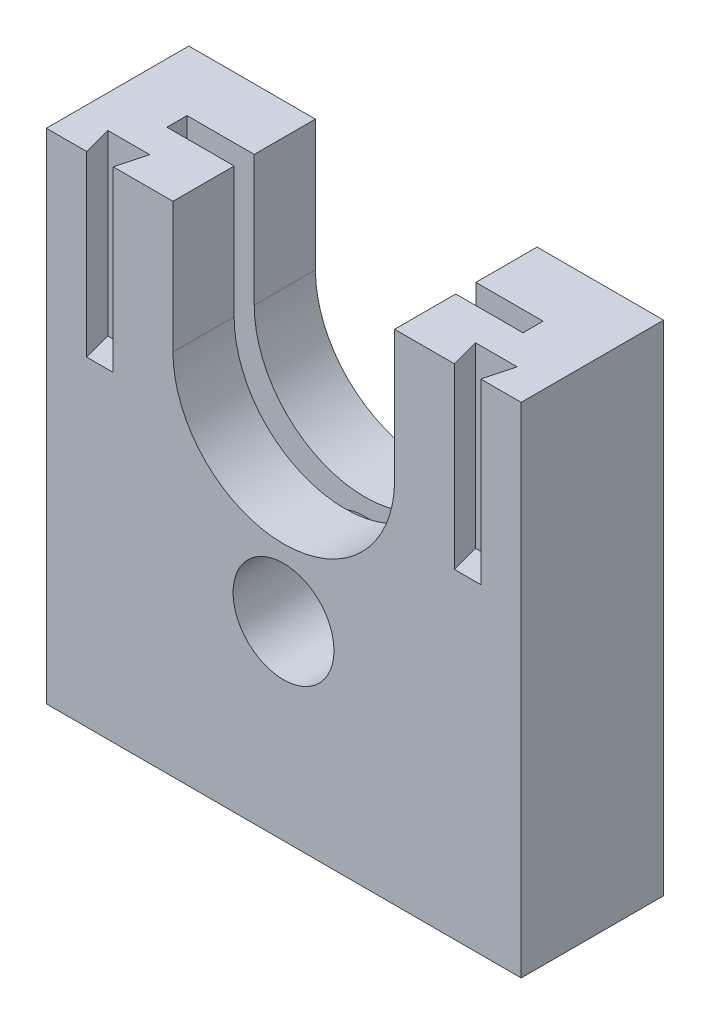
ISO-10303-21;
HEADER;
FILE_DESCRIPTION(('STEP AP214'),'2;1');
FILE_NAME('part.step','',(''),(''),'','','');
FILE_SCHEMA(('AUTOMOTIVE_DESIGN { 1 0 10303 214 1 1 1 1 }'));
ENDSEC;
DATA;
#1=APPLICATION_CONTEXT('core data for automotive mechanical design processes');
#2=APPLICATION_PROTOCOL_DEFINITION('international standard','automotive_design',2000,#1);
#3=PRODUCT_CONTEXT('',#1,'mechanical');
#4=PRODUCT('Part','Part','',(#3));
#5=PRODUCT_RELATED_PRODUCT_CATEGORY('part','',(#4));
#6=PRODUCT_DEFINITION_FORMATION('','',#4);
#7=PRODUCT_DEFINITION_CONTEXT('part definition',#1,'design');
#8=PRODUCT_DEFINITION('design','',#6,#7);
#9=PRODUCT_DEFINITION_SHAPE('','',#8);
#10=(LENGTH_UNIT() NAMED_UNIT(*) SI_UNIT(.MILLI.,.METRE.));
#11=(NAMED_UNIT(*) PLANE_ANGLE_UNIT() SI_UNIT($,.RADIAN.));
#12=(NAMED_UNIT(*) SI_UNIT($,.STERADIAN.) SOLID_ANGLE_UNIT());
#13=UNCERTAINTY_MEASURE_WITH_UNIT(LENGTH_MEASURE(1.E-05),#10,'distance_accuracy_value','');
#14=(GEOMETRIC_REPRESENTATION_CONTEXT(3) GLOBAL_UNCERTAINTY_ASSIGNED_CONTEXT((#13)) GLOBAL_UNIT_ASSIGNED_CONTEXT((#10,
#11,#12)) REPRESENTATION_CONTEXT('',''));
#15=CARTESIAN_POINT('',(0.,0.,0.));
#16=DIRECTION('',(0.,0.,1.));
#17=DIRECTION('',(1.,0.,0.));
#18=AXIS2_PLACEMENT_3D('',#15,#16,#17);
#19=CARTESIAN_POINT('',(0.,7.46153846153847,0.));
#20=DIRECTION('',(0.,-1.,0.));
#21=DIRECTION('',(0.,0.,-1.));
#22=AXIS2_PLACEMENT_3D('',#19,#20,#21);
#23=PLANE('',#22);
#24=DIRECTION('',(-1.,0.,0.));
#25=VECTOR('',#24,1.);
#26=CARTESIAN_POINT('',(-16.4871794871795,7.46153846153847,5.15229744595904));
#27=LINE('',#26,#25);
#28=CARTESIAN_POINT('',(13.5128205128205,7.46153846153847,5.15229744595904));
#29=VERTEX_POINT('',#28);
#30=CARTESIAN_POINT('',(2.62131782107196,7.46153846153847,5.15229744595904));
#31=VERTEX_POINT('',#30);
#32=EDGE_CURVE('E273',#29,#31,#27,.T.);
#33=ORIENTED_EDGE('',*,*,#32,.T.);
#34=DIRECTION('',(0.,0.,1.));
#35=VECTOR('',#34,1.);
#36=CARTESIAN_POINT('',(2.62131782107196,7.46153846153847,4.9));
#37=LINE('',#36,#35);
#38=CARTESIAN_POINT('',(2.62131782107196,7.46153846153847,6.84770255404097));
#39=VERTEX_POINT('',#38);
#40=EDGE_CURVE('E11',#31,#39,#37,.T.);
#41=ORIENTED_EDGE('',*,*,#40,.T.);
#42=DIRECTION('',(1.,0.,0.));
#43=VECTOR('',#42,1.);
#44=CARTESIAN_POINT('',(-16.4871794871795,7.46153846153847,6.84770255404097));
#45=LINE('',#44,#43);
#46=CARTESIAN_POINT('',(13.5128205128205,7.46153846153847,6.84770255404097));
#47=VERTEX_POINT('',#46);
#48=EDGE_CURVE('E279',#39,#47,#45,.T.);
#49=ORIENTED_EDGE('',*,*,#48,.T.);
#50=DIRECTION('',(0.,0.,-1.));
#51=VECTOR('',#50,1.);
#52=CARTESIAN_POINT('',(13.5128205128205,7.46153846153847,6.84770255404097));
#53=LINE('',#52,#51);
#54=EDGE_CURVE('E268',#47,#29,#53,.T.);
#55=ORIENTED_EDGE('',*,*,#54,.T.);
#56=EDGE_LOOP('',(#33,#41,#49,#55));
#57=FACE_BOUND('',#56,.T.);
#58=ADVANCED_FACE('F37',(#57),#23,.F.);
#59=CARTESIAN_POINT('',(-1.4871794871795,21.4615384615385,0.));
#60=DIRECTION('',(0.,0.,1.));
#61=DIRECTION('',(1.,0.,0.));
#62=AXIS2_PLACEMENT_3D('',#59,#60,#61);
#63=CYLINDRICAL_SURFACE('',#62,9.33629045959129);
#64=DIRECTION('',(0.,0.,1.));
#65=VECTOR('',#64,1.);
#66=CARTESIAN_POINT('',(7.84911097241179,21.4615384615385,0.));
#67=LINE('',#66,#65);
#68=CARTESIAN_POINT('',(7.84911097241179,21.4615384615385,6.84770255404097));
#69=VERTEX_POINT('',#68);
#70=CARTESIAN_POINT('',(7.84911097241179,21.4615384615385,12.));
#71=VERTEX_POINT('',#70);
#72=EDGE_CURVE('E322',#69,#71,#67,.T.);
#73=ORIENTED_EDGE('',*,*,#72,.F.);
#74=CARTESIAN_POINT('',(-1.4871794871795,21.4615384615385,6.84770255404097));
#75=DIRECTION('',(0.,0.,1.));
#76=DIRECTION('',(1.,0.,0.));
#77=AXIS2_PLACEMENT_3D('',#74,#75,#76);
#78=CIRCLE('',#77,9.33629045959129);
#79=CARTESIAN_POINT('',(-10.8234699467708,21.4615384615385,6.84770255404097));
#80=VERTEX_POINT('',#79);
#81=EDGE_CURVE('E308',#69,#80,#78,.F.);
#82=ORIENTED_EDGE('',*,*,#81,.T.);
#83=DIRECTION('',(0.,0.,1.));
#84=VECTOR('',#83,1.);
#85=CARTESIAN_POINT('',(-10.8234699467708,21.4615384615385,0.));
#86=LINE('',#85,#84);
#87=CARTESIAN_POINT('',(-10.8234699467708,21.4615384615385,12.));
#88=VERTEX_POINT('',#87);
#89=EDGE_CURVE('E334',#80,#88,#86,.T.);
#90=ORIENTED_EDGE('',*,*,#89,.T.);
#91=CARTESIAN_POINT('',(-1.4871794871795,21.4615384615385,12.));
#92=DIRECTION('',(0.,0.,1.));
#93=DIRECTION('',(1.,0.,0.));
#94=AXIS2_PLACEMENT_3D('',#91,#92,#93);
#95=CIRCLE('',#94,9.33629045959129);
#96=EDGE_CURVE('E314',#88,#71,#95,.T.);
#97=ORIENTED_EDGE('',*,*,#96,.T.);
#98=EDGE_LOOP('',(#73,#82,#90,#97));
#99=FACE_BOUND('',#98,.T.);
#100=ADVANCED_FACE('F454',(#99),#63,.F.);
#101=CARTESIAN_POINT('',(-10.8234699467708,21.4615384615385,0.));
#102=DIRECTION('',(-1.,0.,0.));
#103=DIRECTION('',(0.,0.,1.));
#104=AXIS2_PLACEMENT_3D('',#101,#102,#103);
#105=PLANE('',#104);
#106=ORIENTED_EDGE('',*,*,#89,.F.);
#107=DIRECTION('',(0.,1.,0.));
#108=VECTOR('',#107,1.);
#109=CARTESIAN_POINT('',(-10.8234699467708,21.4615384615385,6.84770255404097));
#110=LINE('',#109,#108);
#111=CARTESIAN_POINT('',(-10.8234699467708,32.4615384615385,6.84770255404097));
#112=VERTEX_POINT('',#111);
#113=EDGE_CURVE('E311',#80,#112,#110,.T.);
#114=ORIENTED_EDGE('',*,*,#113,.T.);
#115=DIRECTION('',(0.,0.,1.));
#116=VECTOR('',#115,1.);
#117=CARTESIAN_POINT('',(-10.8234699467708,32.4615384615385,0.));
#118=LINE('',#117,#116);
#119=CARTESIAN_POINT('',(-10.8234699467708,32.4615384615385,12.));
#120=VERTEX_POINT('',#119);
#121=EDGE_CURVE('E338',#112,#120,#118,.T.);
#122=ORIENTED_EDGE('',*,*,#121,.T.);
#123=DIRECTION('',(0.,-1.,0.));
#124=VECTOR('',#123,1.);
#125=CARTESIAN_POINT('',(-10.8234699467708,21.4615384615385,12.));
#126=LINE('',#125,#124);
#127=EDGE_CURVE('E317',#120,#88,#126,.T.);
#128=ORIENTED_EDGE('',*,*,#127,.T.);
#129=EDGE_LOOP('',(#106,#114,#122,#128));
#130=FACE_BOUND('',#129,.T.);
#131=ADVANCED_FACE('F449',(#130),#105,.F.);
#132=CARTESIAN_POINT('',(7.84911097241179,21.4615384615385,0.));
#133=DIRECTION('',(1.,0.,0.));
#134=DIRECTION('',(0.,0.,-1.));
#135=AXIS2_PLACEMENT_3D('',#132,#133,#134);
#136=PLANE('',#135);
#137=DIRECTION('',(0.,0.,1.));
#138=VECTOR('',#137,1.);
#139=CARTESIAN_POINT('',(7.84911097241179,32.4615384615385,0.));
#140=LINE('',#139,#138);
#141=CARTESIAN_POINT('',(7.84911097241179,32.4615384615385,6.84770255404097));
#142=VERTEX_POINT('',#141);
#143=CARTESIAN_POINT('',(7.84911097241179,32.4615384615385,12.));
#144=VERTEX_POINT('',#143);
#145=EDGE_CURVE('E341',#142,#144,#140,.T.);
#146=ORIENTED_EDGE('',*,*,#145,.F.);
#147=DIRECTION('',(0.,-1.,0.));
#148=VECTOR('',#147,1.);
#149=CARTESIAN_POINT('',(7.84911097241179,21.4615384615385,6.84770255404097));
#150=LINE('',#149,#148);
#151=EDGE_CURVE('E410',#142,#69,#150,.T.);
#152=ORIENTED_EDGE('',*,*,#151,.T.);
#153=ORIENTED_EDGE('',*,*,#72,.T.);
#154=DIRECTION('',(0.,1.,0.));
#155=VECTOR('',#154,1.);
#156=CARTESIAN_POINT('',(7.84911097241179,21.4615384615385,12.));
#157=LINE('',#156,#155);
#158=EDGE_CURVE('E325',#71,#144,#157,.T.);
#159=ORIENTED_EDGE('',*,*,#158,.T.);
#160=EDGE_LOOP('',(#146,#152,#153,#159));
#161=FACE_BOUND('',#160,.T.);
#162=ADVANCED_FACE('F458',(#161),#136,.F.);
#163=CARTESIAN_POINT('',(-19.4871794871795,32.4615384615385,12.));
#164=DIRECTION('',(0.,-1.,0.));
#165=DIRECTION('',(0.,0.,-1.));
#166=AXIS2_PLACEMENT_3D('',#163,#164,#165);
#167=PLANE('',#166);
#168=ORIENTED_EDGE('',*,*,#121,.F.);
#169=DIRECTION('',(1.,0.,0.));
#170=VECTOR('',#169,1.);
#171=CARTESIAN_POINT('',(-16.4871794871795,32.4615384615385,6.84770255404097));
#172=LINE('',#171,#170);
#173=CARTESIAN_POINT('',(-16.4871794871795,32.4615384615385,6.84770255404097));
#174=VERTEX_POINT('',#173);
#175=EDGE_CURVE('E272',#174,#112,#172,.T.);
#176=ORIENTED_EDGE('',*,*,#175,.F.);
#177=DIRECTION('',(0.,0.,1.));
#178=VECTOR('',#177,1.);
#179=CARTESIAN_POINT('',(-16.4871794871795,32.4615384615385,6.84770255404097));
#180=LINE('',#179,#178);
#181=CARTESIAN_POINT('',(-16.4871794871795,32.4615384615385,5.15229744595904));
#182=VERTEX_POINT('',#181);
#183=EDGE_CURVE('E288',#182,#174,#180,.T.);
#184=ORIENTED_EDGE('',*,*,#183,.F.);
#185=DIRECTION('',(-1.,0.,0.));
#186=VECTOR('',#185,1.);
#187=CARTESIAN_POINT('',(-16.4871794871795,32.4615384615385,5.15229744595904));
#188=LINE('',#187,#186);
#189=CARTESIAN_POINT('',(-10.8234699467708,32.4615384615385,5.15229744595904));
#190=VERTEX_POINT('',#189);
#191=EDGE_CURVE('E286',#190,#182,#188,.T.);
#192=ORIENTED_EDGE('',*,*,#191,.F.);
#193=CARTESIAN_POINT('',(-10.8234699467708,32.4615384615385,0.));
#194=VERTEX_POINT('',#193);
#195=EDGE_CURVE('E335',#194,#190,#118,.T.);
#196=ORIENTED_EDGE('',*,*,#195,.F.);
#197=DIRECTION('',(-1.,0.,0.));
#198=VECTOR('',#197,1.);
#199=CARTESIAN_POINT('',(-19.4871794871795,32.4615384615385,0.));
#200=LINE('',#199,#198);
#201=CARTESIAN_POINT('',(-21.4871794871795,32.4615384615385,0.));
#202=VERTEX_POINT('',#201);
#203=EDGE_CURVE('E224',#194,#202,#200,.T.);
#204=ORIENTED_EDGE('',*,*,#203,.T.);
#205=DIRECTION('',(0.,0.,1.));
#206=VECTOR('',#205,1.);
#207=CARTESIAN_POINT('',(-21.4871794871795,32.4615384615385,0.));
#208=LINE('',#207,#206);
#209=CARTESIAN_POINT('',(-21.4871794871795,32.4615384615385,12.));
#210=VERTEX_POINT('',#209);
#211=EDGE_CURVE('E241',#202,#210,#208,.T.);
#212=ORIENTED_EDGE('',*,*,#211,.T.);
#213=DIRECTION('',(-1.,0.,0.));
#214=VECTOR('',#213,1.);
#215=CARTESIAN_POINT('',(-19.4871794871795,32.4615384615385,12.));
#216=LINE('',#215,#214);
#217=CARTESIAN_POINT('',(-18.0871794871795,32.4615384615385,12.));
#218=VERTEX_POINT('',#217);
#219=EDGE_CURVE('E403',#218,#210,#216,.T.);
#220=ORIENTED_EDGE('',*,*,#219,.F.);
#221=DIRECTION('',(0.258819045102518,0.,0.965925826289069));
#222=VECTOR('',#221,1.);
#223=CARTESIAN_POINT('',(-18.0871794871795,32.4615384615385,12.));
#224=LINE('',#223,#222);
#225=CARTESIAN_POINT('',(-18.736956278825,32.4615384615385,9.575));
#226=VERTEX_POINT('',#225);
#227=EDGE_CURVE('E349',#226,#218,#224,.T.);
#228=ORIENTED_EDGE('',*,*,#227,.F.);
#229=DIRECTION('',(-1.,0.,0.));
#230=VECTOR('',#229,1.);
#231=CARTESIAN_POINT('',(-18.736956278825,32.4615384615385,9.575));
#232=LINE('',#231,#230);
#233=CARTESIAN_POINT('',(-15.212402695534,32.4615384615385,9.575));
#234=VERTEX_POINT('',#233);
#235=EDGE_CURVE('E361',#234,#226,#232,.T.);
#236=ORIENTED_EDGE('',*,*,#235,.F.);
#237=DIRECTION('',(0.258819045102518,0.,-0.965925826289069));
#238=VECTOR('',#237,1.);
#239=CARTESIAN_POINT('',(-15.212402695534,32.4615384615385,9.575));
#240=LINE('',#239,#238);
#241=CARTESIAN_POINT('',(-15.8621794871795,32.4615384615385,12.));
#242=VERTEX_POINT('',#241);
#243=EDGE_CURVE('E358',#242,#234,#240,.T.);
#244=ORIENTED_EDGE('',*,*,#243,.F.);
#245=EDGE_CURVE('E407',#120,#242,#216,.T.);
#246=ORIENTED_EDGE('',*,*,#245,.F.);
#247=EDGE_LOOP('',(#168,#176,#184,#192,#196,#204,#212,#220,#228,#236,#244,#246));
#248=FACE_BOUND('',#247,.T.);
#249=ADVANCED_FACE('F444',(#248),#167,.F.);
#250=CARTESIAN_POINT('',(-19.4871794871795,-9.53846153846153,12.));
#251=DIRECTION('',(0.,1.,0.));
#252=DIRECTION('',(0.,0.,1.));
#253=AXIS2_PLACEMENT_3D('',#250,#251,#252);
#254=PLANE('',#253);
#255=DIRECTION('',(1.,0.,0.));
#256=VECTOR('',#255,1.);
#257=CARTESIAN_POINT('',(-19.4871794871795,-9.53846153846153,0.));
#258=LINE('',#257,#256);
#259=CARTESIAN_POINT('',(-21.4871794871795,-9.53846153846153,0.));
#260=VERTEX_POINT('',#259);
#261=CARTESIAN_POINT('',(18.5128205128205,-9.53846153846153,0.));
#262=VERTEX_POINT('',#261);
#263=EDGE_CURVE('E369',#260,#262,#258,.T.);
#264=ORIENTED_EDGE('',*,*,#263,.T.);
#265=DIRECTION('',(0.,0.,-1.));
#266=VECTOR('',#265,1.);
#267=CARTESIAN_POINT('',(18.5128205128205,-9.53846153846153,0.));
#268=LINE('',#267,#266);
#269=CARTESIAN_POINT('',(18.5128205128205,-9.53846153846153,12.));
#270=VERTEX_POINT('',#269);
#271=EDGE_CURVE('E232',#270,#262,#268,.T.);
#272=ORIENTED_EDGE('',*,*,#271,.F.);
#273=DIRECTION('',(1.,0.,0.));
#274=VECTOR('',#273,1.);
#275=CARTESIAN_POINT('',(-19.4871794871795,-9.53846153846153,12.));
#276=LINE('',#275,#274);
#277=CARTESIAN_POINT('',(-21.4871794871795,-9.53846153846153,12.));
#278=VERTEX_POINT('',#277);
#279=EDGE_CURVE('E223',#278,#270,#276,.T.);
#280=ORIENTED_EDGE('',*,*,#279,.F.);
#281=DIRECTION('',(0.,0.,1.));
#282=VECTOR('',#281,1.);
#283=CARTESIAN_POINT('',(-21.4871794871795,-9.53846153846153,0.));
#284=LINE('',#283,#282);
#285=EDGE_CURVE('E244',#260,#278,#284,.T.);
#286=ORIENTED_EDGE('',*,*,#285,.F.);
#287=EDGE_LOOP('',(#264,#272,#280,#286));
#288=FACE_BOUND('',#287,.T.);
#289=ADVANCED_FACE('F39',(#288),#254,.F.);
#290=DIRECTION('',(0.,0.,-1.));
#291=VECTOR('',#290,1.);
#292=CARTESIAN_POINT('',(13.5128205128205,32.4615384615385,6.84770255404097));
#293=LINE('',#292,#291);
#294=CARTESIAN_POINT('',(13.5128205128205,32.4615384615385,6.84770255404097));
#295=VERTEX_POINT('',#294);
#296=CARTESIAN_POINT('',(13.5128205128205,32.4615384615385,5.15229744595904));
#297=VERTEX_POINT('',#296);
#298=EDGE_CURVE('E267',#295,#297,#293,.T.);
#299=ORIENTED_EDGE('',*,*,#298,.F.);
#300=EDGE_CURVE('E291',#142,#295,#172,.T.);
#301=ORIENTED_EDGE('',*,*,#300,.F.);
#302=ORIENTED_EDGE('',*,*,#145,.T.);
#303=CARTESIAN_POINT('',(12.8878205128205,32.4615384615385,12.));
#304=VERTEX_POINT('',#303);
#305=EDGE_CURVE('E406',#304,#144,#216,.T.);
#306=ORIENTED_EDGE('',*,*,#305,.F.);
#307=DIRECTION('',(0.258819045102525,0.,0.965925826289067));
#308=VECTOR('',#307,1.);
#309=CARTESIAN_POINT('',(12.238043721175,32.4615384615385,9.575));
#310=LINE('',#309,#308);
#311=CARTESIAN_POINT('',(12.238043721175,32.4615384615385,9.575));
#312=VERTEX_POINT('',#311);
#313=EDGE_CURVE('E385',#312,#304,#310,.T.);
#314=ORIENTED_EDGE('',*,*,#313,.F.);
#315=DIRECTION('',(-1.,0.,0.));
#316=VECTOR('',#315,1.);
#317=CARTESIAN_POINT('',(15.762597304466,32.4615384615385,9.575));
#318=LINE('',#317,#316);
#319=CARTESIAN_POINT('',(15.762597304466,32.4615384615385,9.575));
#320=VERTEX_POINT('',#319);
#321=EDGE_CURVE('E387',#320,#312,#318,.T.);
#322=ORIENTED_EDGE('',*,*,#321,.F.);
#323=DIRECTION('',(0.258819045102525,0.,-0.965925826289067));
#324=VECTOR('',#323,1.);
#325=CARTESIAN_POINT('',(15.1128205128205,32.4615384615385,12.));
#326=LINE('',#325,#324);
#327=CARTESIAN_POINT('',(15.1128205128205,32.4615384615385,12.));
#328=VERTEX_POINT('',#327);
#329=EDGE_CURVE('E362',#328,#320,#326,.T.);
#330=ORIENTED_EDGE('',*,*,#329,.F.);
#331=CARTESIAN_POINT('',(18.5128205128205,32.4615384615385,12.));
#332=VERTEX_POINT('',#331);
#333=EDGE_CURVE('E239',#332,#328,#216,.T.);
#334=ORIENTED_EDGE('',*,*,#333,.F.);
#335=DIRECTION('',(0.,0.,-1.));
#336=VECTOR('',#335,1.);
#337=CARTESIAN_POINT('',(18.5128205128205,32.4615384615385,0.));
#338=LINE('',#337,#336);
#339=CARTESIAN_POINT('',(18.5128205128205,32.4615384615385,0.));
#340=VERTEX_POINT('',#339);
#341=EDGE_CURVE('E230',#332,#340,#338,.T.);
#342=ORIENTED_EDGE('',*,*,#341,.T.);
#343=CARTESIAN_POINT('',(7.84911097241179,32.4615384615385,0.));
#344=VERTEX_POINT('',#343);
#345=EDGE_CURVE('E211',#340,#344,#200,.T.);
#346=ORIENTED_EDGE('',*,*,#345,.T.);
#347=CARTESIAN_POINT('',(7.84911097241179,32.4615384615385,5.15229744595904));
#348=VERTEX_POINT('',#347);
#349=EDGE_CURVE('E339',#344,#348,#140,.T.);
#350=ORIENTED_EDGE('',*,*,#349,.T.);
#351=EDGE_CURVE('E60',#297,#348,#188,.T.);
#352=ORIENTED_EDGE('',*,*,#351,.F.);
#353=EDGE_LOOP('',(#299,#301,#302,#306,#314,#322,#330,#334,#342,#346,#350,#352));
#354=FACE_BOUND('',#353,.T.);
#355=ADVANCED_FACE('F236',(#354),#167,.F.);
#356=CARTESIAN_POINT('',(0.,0.,12.));
#357=DIRECTION('',(0.,0.,1.));
#358=DIRECTION('',(1.,0.,0.));
#359=AXIS2_PLACEMENT_3D('',#356,#357,#358);
#360=PLANE('',#359);
#361=CARTESIAN_POINT('',(-1.50936008939262,6.46153846153847,12.));
#362=DIRECTION('',(0.,0.,1.));
#363=DIRECTION('',(1.,0.,0.));
#364=AXIS2_PLACEMENT_3D('',#361,#362,#363);
#365=CIRCLE('',#364,4.25);
#366=CARTESIAN_POINT('',(2.74063991060738,6.46153846153847,12.));
#367=VERTEX_POINT('',#366);
#368=EDGE_CURVE('E255',#367,#367,#365,.T.);
#369=ORIENTED_EDGE('',*,*,#368,.F.);
#370=EDGE_LOOP('',(#369));
#371=FACE_BOUND('',#370,.T.);
#372=ORIENTED_EDGE('',*,*,#127,.F.);
#373=ORIENTED_EDGE('',*,*,#245,.T.);
#374=DIRECTION('',(0.,1.,0.));
#375=VECTOR('',#374,1.);
#376=CARTESIAN_POINT('',(-15.8621794871795,17.4615384615385,12.));
#377=LINE('',#376,#375);
#378=CARTESIAN_POINT('',(-15.8621794871795,17.4615384615385,12.));
#379=VERTEX_POINT('',#378);
#380=EDGE_CURVE('E357',#379,#242,#377,.T.);
#381=ORIENTED_EDGE('',*,*,#380,.F.);
#382=DIRECTION('',(1.,0.,0.));
#383=VECTOR('',#382,1.);
#384=CARTESIAN_POINT('',(-18.0871794871795,17.4615384615385,12.));
#385=LINE('',#384,#383);
#386=CARTESIAN_POINT('',(-18.0871794871795,17.4615384615385,12.));
#387=VERTEX_POINT('',#386);
#388=EDGE_CURVE('E345',#387,#379,#385,.T.);
#389=ORIENTED_EDGE('',*,*,#388,.F.);
#390=DIRECTION('',(0.,1.,0.));
#391=VECTOR('',#390,1.);
#392=CARTESIAN_POINT('',(-18.0871794871795,17.4615384615385,12.));
#393=LINE('',#392,#391);
#394=EDGE_CURVE('E366',#387,#218,#393,.T.);
#395=ORIENTED_EDGE('',*,*,#394,.T.);
#396=ORIENTED_EDGE('',*,*,#219,.T.);
#397=DIRECTION('',(0.,1.,0.));
#398=VECTOR('',#397,1.);
#399=CARTESIAN_POINT('',(-21.4871794871795,-9.53846153846153,12.));
#400=LINE('',#399,#398);
#401=EDGE_CURVE('E252',#278,#210,#400,.T.);
#402=ORIENTED_EDGE('',*,*,#401,.F.);
#403=ORIENTED_EDGE('',*,*,#279,.T.);
#404=DIRECTION('',(0.,1.,0.));
#405=VECTOR('',#404,1.);
#406=CARTESIAN_POINT('',(18.5128205128205,-9.53846153846153,12.));
#407=LINE('',#406,#405);
#408=EDGE_CURVE('E233',#270,#332,#407,.T.);
#409=ORIENTED_EDGE('',*,*,#408,.T.);
#410=ORIENTED_EDGE('',*,*,#333,.T.);
#411=DIRECTION('',(0.,1.,0.));
#412=VECTOR('',#411,1.);
#413=CARTESIAN_POINT('',(15.1128205128205,17.4615384615385,12.));
#414=LINE('',#413,#412);
#415=CARTESIAN_POINT('',(15.1128205128205,17.4615384615385,12.));
#416=VERTEX_POINT('',#415);
#417=EDGE_CURVE('E376',#416,#328,#414,.T.);
#418=ORIENTED_EDGE('',*,*,#417,.F.);
#419=DIRECTION('',(1.,0.,0.));
#420=VECTOR('',#419,1.);
#421=CARTESIAN_POINT('',(15.1128205128205,17.4615384615385,12.));
#422=LINE('',#421,#420);
#423=CARTESIAN_POINT('',(12.8878205128205,17.4615384615385,12.));
#424=VERTEX_POINT('',#423);
#425=EDGE_CURVE('E388',#424,#416,#422,.T.);
#426=ORIENTED_EDGE('',*,*,#425,.F.);
#427=DIRECTION('',(0.,1.,0.));
#428=VECTOR('',#427,1.);
#429=CARTESIAN_POINT('',(12.8878205128205,17.4615384615385,12.));
#430=LINE('',#429,#428);
#431=EDGE_CURVE('E333',#424,#304,#430,.T.);
#432=ORIENTED_EDGE('',*,*,#431,.T.);
#433=ORIENTED_EDGE('',*,*,#305,.T.);
#434=ORIENTED_EDGE('',*,*,#158,.F.);
#435=ORIENTED_EDGE('',*,*,#96,.F.);
#436=EDGE_LOOP('',(#372,#373,#381,#389,#395,#396,#402,#403,#409,#410,#418,#426,#432,#433,#434,#435));
#437=FACE_BOUND('',#436,.T.);
#438=ADVANCED_FACE('F466',(#371,#437),#360,.T.);
#439=CARTESIAN_POINT('',(0.,0.,0.));
#440=DIRECTION('',(0.,0.,1.));
#441=DIRECTION('',(1.,0.,0.));
#442=AXIS2_PLACEMENT_3D('',#439,#440,#441);
#443=PLANE('',#442);
#444=ORIENTED_EDGE('',*,*,#203,.F.);
#445=DIRECTION('',(0.,-1.,0.));
#446=VECTOR('',#445,1.);
#447=CARTESIAN_POINT('',(-10.8234699467708,21.4615384615385,0.));
#448=LINE('',#447,#446);
#449=CARTESIAN_POINT('',(-10.8234699467708,21.4615384615385,0.));
#450=VERTEX_POINT('',#449);
#451=EDGE_CURVE('E319',#194,#450,#448,.T.);
#452=ORIENTED_EDGE('',*,*,#451,.T.);
#453=CARTESIAN_POINT('',(-1.4871794871795,21.4615384615385,0.));
#454=DIRECTION('',(0.,0.,1.));
#455=DIRECTION('',(1.,0.,0.));
#456=AXIS2_PLACEMENT_3D('',#453,#454,#455);
#457=CIRCLE('',#456,9.33629045959129);
#458=CARTESIAN_POINT('',(7.84911097241179,21.4615384615385,0.));
#459=VERTEX_POINT('',#458);
#460=EDGE_CURVE('E315',#450,#459,#457,.T.);
#461=ORIENTED_EDGE('',*,*,#460,.T.);
#462=DIRECTION('',(0.,1.,0.));
#463=VECTOR('',#462,1.);
#464=CARTESIAN_POINT('',(7.84911097241179,21.4615384615385,0.));
#465=LINE('',#464,#463);
#466=EDGE_CURVE('E219',#459,#344,#465,.T.);
#467=ORIENTED_EDGE('',*,*,#466,.T.);
#468=ORIENTED_EDGE('',*,*,#345,.F.);
#469=DIRECTION('',(0.,1.,0.));
#470=VECTOR('',#469,1.);
#471=CARTESIAN_POINT('',(18.5128205128205,-9.53846153846153,0.));
#472=LINE('',#471,#470);
#473=EDGE_CURVE('E215',#262,#340,#472,.T.);
#474=ORIENTED_EDGE('',*,*,#473,.F.);
#475=ORIENTED_EDGE('',*,*,#263,.F.);
#476=DIRECTION('',(0.,1.,0.));
#477=VECTOR('',#476,1.);
#478=CARTESIAN_POINT('',(-21.4871794871795,-9.53846153846153,0.));
#479=LINE('',#478,#477);
#480=EDGE_CURVE('E250',#260,#202,#479,.T.);
#481=ORIENTED_EDGE('',*,*,#480,.T.);
#482=EDGE_LOOP('',(#444,#452,#461,#467,#468,#474,#475,#481));
#483=FACE_BOUND('',#482,.T.);
#484=ADVANCED_FACE('F214',(#483),#443,.F.);
#485=CARTESIAN_POINT('',(12.238043721175,17.4615384615385,9.575));
#486=DIRECTION('',(-0.965925826289067,0.,0.258819045102525));
#487=DIRECTION('',(0.258819045102525,0.,0.965925826289067));
#488=AXIS2_PLACEMENT_3D('',#485,#486,#487);
#489=PLANE('',#488);
#490=ORIENTED_EDGE('',*,*,#313,.T.);
#491=ORIENTED_EDGE('',*,*,#431,.F.);
#492=DIRECTION('',(0.258819045102525,0.,0.965925826289067));
#493=VECTOR('',#492,1.);
#494=CARTESIAN_POINT('',(12.238043721175,17.4615384615385,9.575));
#495=LINE('',#494,#493);
#496=CARTESIAN_POINT('',(12.238043721175,17.4615384615385,9.575));
#497=VERTEX_POINT('',#496);
#498=EDGE_CURVE('E378',#497,#424,#495,.T.);
#499=ORIENTED_EDGE('',*,*,#498,.F.);
#500=DIRECTION('',(0.,1.,0.));
#501=VECTOR('',#500,1.);
#502=CARTESIAN_POINT('',(12.238043721175,17.4615384615385,9.575));
#503=LINE('',#502,#501);
#504=EDGE_CURVE('E381',#497,#312,#503,.T.);
#505=ORIENTED_EDGE('',*,*,#504,.T.);
#506=EDGE_LOOP('',(#490,#491,#499,#505));
#507=FACE_BOUND('',#506,.T.);
#508=ADVANCED_FACE('F488',(#507),#489,.F.);
#509=CARTESIAN_POINT('',(15.762597304466,17.4615384615385,9.575));
#510=DIRECTION('',(0.,0.,-1.));
#511=DIRECTION('',(-1.,0.,0.));
#512=AXIS2_PLACEMENT_3D('',#509,#510,#511);
#513=PLANE('',#512);
#514=ORIENTED_EDGE('',*,*,#321,.T.);
#515=ORIENTED_EDGE('',*,*,#504,.F.);
#516=DIRECTION('',(-1.,0.,0.));
#517=VECTOR('',#516,1.);
#518=CARTESIAN_POINT('',(15.762597304466,17.4615384615385,9.575));
#519=LINE('',#518,#517);
#520=CARTESIAN_POINT('',(15.762597304466,17.4615384615385,9.575));
#521=VERTEX_POINT('',#520);
#522=EDGE_CURVE('E394',#521,#497,#519,.T.);
#523=ORIENTED_EDGE('',*,*,#522,.F.);
#524=DIRECTION('',(0.,1.,0.));
#525=VECTOR('',#524,1.);
#526=CARTESIAN_POINT('',(15.762597304466,17.4615384615385,9.575));
#527=LINE('',#526,#525);
#528=EDGE_CURVE('E379',#521,#320,#527,.T.);
#529=ORIENTED_EDGE('',*,*,#528,.T.);
#530=EDGE_LOOP('',(#514,#515,#523,#529));
#531=FACE_BOUND('',#530,.T.);
#532=ADVANCED_FACE('F481',(#531),#513,.F.);
#533=CARTESIAN_POINT('',(15.1128205128205,17.4615384615385,12.));
#534=DIRECTION('',(0.965925826289067,0.,0.258819045102525));
#535=DIRECTION('',(0.258819045102525,0.,-0.965925826289067));
#536=AXIS2_PLACEMENT_3D('',#533,#534,#535);
#537=PLANE('',#536);
#538=ORIENTED_EDGE('',*,*,#329,.T.);
#539=ORIENTED_EDGE('',*,*,#528,.F.);
#540=DIRECTION('',(0.258819045102525,0.,-0.965925826289067));
#541=VECTOR('',#540,1.);
#542=CARTESIAN_POINT('',(15.1128205128205,17.4615384615385,12.));
#543=LINE('',#542,#541);
#544=EDGE_CURVE('E397',#416,#521,#543,.T.);
#545=ORIENTED_EDGE('',*,*,#544,.F.);
#546=ORIENTED_EDGE('',*,*,#417,.T.);
#547=EDGE_LOOP('',(#538,#539,#545,#546));
#548=FACE_BOUND('',#547,.T.);
#549=ADVANCED_FACE('F479',(#548),#537,.F.);
#550=CARTESIAN_POINT('',(0.,17.4615384615385,0.));
#551=DIRECTION('',(0.,1.,0.));
#552=DIRECTION('',(0.,0.,1.));
#553=AXIS2_PLACEMENT_3D('',#550,#551,#552);
#554=PLANE('',#553);
#555=ORIENTED_EDGE('',*,*,#425,.T.);
#556=ORIENTED_EDGE('',*,*,#544,.T.);
#557=ORIENTED_EDGE('',*,*,#522,.T.);
#558=ORIENTED_EDGE('',*,*,#498,.T.);
#559=EDGE_LOOP('',(#555,#556,#557,#558));
#560=FACE_BOUND('',#559,.T.);
#561=ADVANCED_FACE('F485',(#560),#554,.T.);
#562=CARTESIAN_POINT('',(-18.0871794871795,17.4615384615385,12.));
#563=DIRECTION('',(-0.965925826289069,0.,0.258819045102518));
#564=DIRECTION('',(0.258819045102518,0.,0.965925826289069));
#565=AXIS2_PLACEMENT_3D('',#562,#563,#564);
#566=PLANE('',#565);
#567=ORIENTED_EDGE('',*,*,#227,.T.);
#568=ORIENTED_EDGE('',*,*,#394,.F.);
#569=DIRECTION('',(0.258819045102518,0.,0.965925826289069));
#570=VECTOR('',#569,1.);
#571=CARTESIAN_POINT('',(-18.0871794871795,17.4615384615385,12.));
#572=LINE('',#571,#570);
#573=CARTESIAN_POINT('',(-18.736956278825,17.4615384615385,9.575));
#574=VERTEX_POINT('',#573);
#575=EDGE_CURVE('E355',#574,#387,#572,.T.);
#576=ORIENTED_EDGE('',*,*,#575,.F.);
#577=DIRECTION('',(0.,1.,0.));
#578=VECTOR('',#577,1.);
#579=CARTESIAN_POINT('',(-18.736956278825,17.4615384615385,9.575));
#580=LINE('',#579,#578);
#581=EDGE_CURVE('E370',#574,#226,#580,.T.);
#582=ORIENTED_EDGE('',*,*,#581,.T.);
#583=EDGE_LOOP('',(#567,#568,#576,#582));
#584=FACE_BOUND('',#583,.T.);
#585=ADVANCED_FACE('F531',(#584),#566,.F.);
#586=CARTESIAN_POINT('',(-18.736956278825,17.4615384615385,9.575));
#587=DIRECTION('',(0.,0.,-1.));
#588=DIRECTION('',(-1.,0.,0.));
#589=AXIS2_PLACEMENT_3D('',#586,#587,#588);
#590=PLANE('',#589);
#591=ORIENTED_EDGE('',*,*,#235,.T.);
#592=ORIENTED_EDGE('',*,*,#581,.F.);
#593=DIRECTION('',(-1.,0.,0.));
#594=VECTOR('',#593,1.);
#595=CARTESIAN_POINT('',(-18.736956278825,17.4615384615385,9.575));
#596=LINE('',#595,#594);
#597=CARTESIAN_POINT('',(-15.212402695534,17.4615384615385,9.575));
#598=VERTEX_POINT('',#597);
#599=EDGE_CURVE('E352',#598,#574,#596,.T.);
#600=ORIENTED_EDGE('',*,*,#599,.F.);
#601=DIRECTION('',(0.,1.,0.));
#602=VECTOR('',#601,1.);
#603=CARTESIAN_POINT('',(-15.212402695534,17.4615384615385,9.575));
#604=LINE('',#603,#602);
#605=EDGE_CURVE('E372',#598,#234,#604,.T.);
#606=ORIENTED_EDGE('',*,*,#605,.T.);
#607=EDGE_LOOP('',(#591,#592,#600,#606));
#608=FACE_BOUND('',#607,.T.);
#609=ADVANCED_FACE('F534',(#608),#590,.F.);
#610=CARTESIAN_POINT('',(-15.212402695534,17.4615384615385,9.575));
#611=DIRECTION('',(0.965925826289069,0.,0.258819045102518));
#612=DIRECTION('',(0.258819045102518,0.,-0.965925826289069));
#613=AXIS2_PLACEMENT_3D('',#610,#611,#612);
#614=PLANE('',#613);
#615=ORIENTED_EDGE('',*,*,#243,.T.);
#616=ORIENTED_EDGE('',*,*,#605,.F.);
#617=DIRECTION('',(0.258819045102518,0.,-0.965925826289069));
#618=VECTOR('',#617,1.);
#619=CARTESIAN_POINT('',(-15.212402695534,17.4615384615385,9.575));
#620=LINE('',#619,#618);
#621=EDGE_CURVE('E348',#379,#598,#620,.T.);
#622=ORIENTED_EDGE('',*,*,#621,.F.);
#623=ORIENTED_EDGE('',*,*,#380,.T.);
#624=EDGE_LOOP('',(#615,#616,#622,#623));
#625=FACE_BOUND('',#624,.T.);
#626=ADVANCED_FACE('F529',(#625),#614,.F.);
#627=CARTESIAN_POINT('',(0.,17.4615384615385,0.));
#628=DIRECTION('',(0.,-1.,0.));
#629=DIRECTION('',(0.,0.,-1.));
#630=AXIS2_PLACEMENT_3D('',#627,#628,#629);
#631=PLANE('',#630);
#632=ORIENTED_EDGE('',*,*,#388,.T.);
#633=ORIENTED_EDGE('',*,*,#621,.T.);
#634=ORIENTED_EDGE('',*,*,#599,.T.);
#635=ORIENTED_EDGE('',*,*,#575,.T.);
#636=EDGE_LOOP('',(#632,#633,#634,#635));
#637=FACE_BOUND('',#636,.T.);
#638=ADVANCED_FACE('F526',(#637),#631,.F.);
#639=CARTESIAN_POINT('',(-10.8234699467708,21.4615384615385,5.15229744595904));
#640=VERTEX_POINT('',#639);
#641=EDGE_CURVE('E330',#450,#640,#86,.T.);
#642=ORIENTED_EDGE('',*,*,#641,.T.);
#643=CARTESIAN_POINT('',(-1.4871794871795,21.4615384615385,5.15229744595904));
#644=DIRECTION('',(0.,0.,-1.));
#645=DIRECTION('',(-1.,0.,0.));
#646=AXIS2_PLACEMENT_3D('',#643,#644,#645);
#647=CIRCLE('',#646,9.33629045959129);
#648=CARTESIAN_POINT('',(7.84911097241179,21.4615384615385,5.15229744595904));
#649=VERTEX_POINT('',#648);
#650=EDGE_CURVE('E296',#640,#649,#647,.F.);
#651=ORIENTED_EDGE('',*,*,#650,.T.);
#652=EDGE_CURVE('E342',#459,#649,#67,.T.);
#653=ORIENTED_EDGE('',*,*,#652,.F.);
#654=ORIENTED_EDGE('',*,*,#460,.F.);
#655=EDGE_LOOP('',(#642,#651,#653,#654));
#656=FACE_BOUND('',#655,.T.);
#657=ADVANCED_FACE('F437',(#656),#63,.F.);
#658=ORIENTED_EDGE('',*,*,#195,.T.);
#659=DIRECTION('',(0.,-1.,0.));
#660=VECTOR('',#659,1.);
#661=CARTESIAN_POINT('',(-10.8234699467708,21.4615384615385,5.15229744595904));
#662=LINE('',#661,#660);
#663=EDGE_CURVE('E305',#190,#640,#662,.T.);
#664=ORIENTED_EDGE('',*,*,#663,.T.);
#665=ORIENTED_EDGE('',*,*,#641,.F.);
#666=ORIENTED_EDGE('',*,*,#451,.F.);
#667=EDGE_LOOP('',(#658,#664,#665,#666));
#668=FACE_BOUND('',#667,.T.);
#669=ADVANCED_FACE('F440',(#668),#105,.F.);
#670=ORIENTED_EDGE('',*,*,#652,.T.);
#671=DIRECTION('',(0.,1.,0.));
#672=VECTOR('',#671,1.);
#673=CARTESIAN_POINT('',(7.84911097241179,21.4615384615385,5.15229744595904));
#674=LINE('',#673,#672);
#675=EDGE_CURVE('E405',#649,#348,#674,.T.);
#676=ORIENTED_EDGE('',*,*,#675,.T.);
#677=ORIENTED_EDGE('',*,*,#349,.F.);
#678=ORIENTED_EDGE('',*,*,#466,.F.);
#679=EDGE_LOOP('',(#670,#676,#677,#678));
#680=FACE_BOUND('',#679,.T.);
#681=ADVANCED_FACE('F435',(#680),#136,.F.);
#682=CARTESIAN_POINT('',(-16.4871794871795,7.46153846153847,6.84770255404097));
#683=DIRECTION('',(0.,0.,1.));
#684=DIRECTION('',(1.,0.,0.));
#685=AXIS2_PLACEMENT_3D('',#682,#683,#684);
#686=PLANE('',#685);
#687=ORIENTED_EDGE('',*,*,#48,.F.);
#688=CARTESIAN_POINT('',(-1.50936008939262,6.46153846153847,6.84770255404097));
#689=DIRECTION('',(0.,0.,1.));
#690=DIRECTION('',(1.,0.,0.));
#691=AXIS2_PLACEMENT_3D('',#688,#689,#690);
#692=CIRCLE('',#691,4.25);
#693=CARTESIAN_POINT('',(-5.64003799985719,7.46153846153847,6.84770255404097));
#694=VERTEX_POINT('',#693);
#695=EDGE_CURVE('E264',#39,#694,#692,.T.);
#696=ORIENTED_EDGE('',*,*,#695,.T.);
#697=CARTESIAN_POINT('',(-16.4871794871795,7.46153846153847,6.84770255404097));
#698=VERTEX_POINT('',#697);
#699=EDGE_CURVE('E280',#698,#694,#45,.T.);
#700=ORIENTED_EDGE('',*,*,#699,.F.);
#701=DIRECTION('',(0.,1.,0.));
#702=VECTOR('',#701,1.);
#703=CARTESIAN_POINT('',(-16.4871794871795,7.46153846153847,6.84770255404097));
#704=LINE('',#703,#702);
#705=EDGE_CURVE('E297',#698,#174,#704,.T.);
#706=ORIENTED_EDGE('',*,*,#705,.T.);
#707=ORIENTED_EDGE('',*,*,#175,.T.);
#708=ORIENTED_EDGE('',*,*,#113,.F.);
#709=ORIENTED_EDGE('',*,*,#81,.F.);
#710=ORIENTED_EDGE('',*,*,#151,.F.);
#711=ORIENTED_EDGE('',*,*,#300,.T.);
#712=DIRECTION('',(0.,1.,0.));
#713=VECTOR('',#712,1.);
#714=CARTESIAN_POINT('',(13.5128205128205,7.46153846153847,6.84770255404097));
#715=LINE('',#714,#713);
#716=EDGE_CURVE('E293',#47,#295,#715,.T.);
#717=ORIENTED_EDGE('',*,*,#716,.F.);
#718=EDGE_LOOP('',(#687,#696,#700,#706,#707,#708,#709,#710,#711,#717));
#719=FACE_BOUND('',#718,.T.);
#720=ADVANCED_FACE('F426',(#719),#686,.F.);
#721=CARTESIAN_POINT('',(-16.4871794871795,7.46153846153847,5.15229744595904));
#722=DIRECTION('',(0.,0.,-1.));
#723=DIRECTION('',(-1.,0.,0.));
#724=AXIS2_PLACEMENT_3D('',#721,#722,#723);
#725=PLANE('',#724);
#726=CARTESIAN_POINT('',(-5.64003799985719,7.46153846153847,5.15229744595904));
#727=VERTEX_POINT('',#726);
#728=CARTESIAN_POINT('',(-16.4871794871795,7.46153846153847,5.15229744595904));
#729=VERTEX_POINT('',#728);
#730=EDGE_CURVE('E271',#727,#729,#27,.T.);
#731=ORIENTED_EDGE('',*,*,#730,.F.);
#732=CARTESIAN_POINT('',(-1.50936008939262,6.46153846153847,5.15229744595904));
#733=DIRECTION('',(0.,0.,-1.));
#734=DIRECTION('',(-1.,0.,0.));
#735=AXIS2_PLACEMENT_3D('',#732,#733,#734);
#736=CIRCLE('',#735,4.25);
#737=EDGE_CURVE('E52',#727,#31,#736,.T.);
#738=ORIENTED_EDGE('',*,*,#737,.T.);
#739=ORIENTED_EDGE('',*,*,#32,.F.);
#740=DIRECTION('',(0.,1.,0.));
#741=VECTOR('',#740,1.);
#742=CARTESIAN_POINT('',(13.5128205128205,7.46153846153847,5.15229744595904));
#743=LINE('',#742,#741);
#744=EDGE_CURVE('E283',#29,#297,#743,.T.);
#745=ORIENTED_EDGE('',*,*,#744,.T.);
#746=ORIENTED_EDGE('',*,*,#351,.T.);
#747=ORIENTED_EDGE('',*,*,#675,.F.);
#748=ORIENTED_EDGE('',*,*,#650,.F.);
#749=ORIENTED_EDGE('',*,*,#663,.F.);
#750=ORIENTED_EDGE('',*,*,#191,.T.);
#751=DIRECTION('',(0.,1.,0.));
#752=VECTOR('',#751,1.);
#753=CARTESIAN_POINT('',(-16.4871794871795,7.46153846153847,5.15229744595904));
#754=LINE('',#753,#752);
#755=EDGE_CURVE('E299',#729,#182,#754,.T.);
#756=ORIENTED_EDGE('',*,*,#755,.F.);
#757=EDGE_LOOP('',(#731,#738,#739,#745,#746,#747,#748,#749,#750,#756));
#758=FACE_BOUND('',#757,.T.);
#759=ADVANCED_FACE('F417',(#758),#725,.F.);
#760=CARTESIAN_POINT('',(13.5128205128205,7.46153846153847,6.84770255404097));
#761=DIRECTION('',(1.,0.,0.));
#762=DIRECTION('',(0.,0.,-1.));
#763=AXIS2_PLACEMENT_3D('',#760,#761,#762);
#764=PLANE('',#763);
#765=ORIENTED_EDGE('',*,*,#298,.T.);
#766=ORIENTED_EDGE('',*,*,#744,.F.);
#767=ORIENTED_EDGE('',*,*,#54,.F.);
#768=ORIENTED_EDGE('',*,*,#716,.T.);
#769=EDGE_LOOP('',(#765,#766,#767,#768));
#770=FACE_BOUND('',#769,.T.);
#771=ADVANCED_FACE('F432',(#770),#764,.F.);
#772=CARTESIAN_POINT('',(-16.4871794871795,7.46153846153847,6.84770255404097));
#773=DIRECTION('',(-1.,0.,0.));
#774=DIRECTION('',(0.,0.,1.));
#775=AXIS2_PLACEMENT_3D('',#772,#773,#774);
#776=PLANE('',#775);
#777=ORIENTED_EDGE('',*,*,#183,.T.);
#778=ORIENTED_EDGE('',*,*,#705,.F.);
#779=DIRECTION('',(0.,0.,1.));
#780=VECTOR('',#779,1.);
#781=CARTESIAN_POINT('',(-16.4871794871795,7.46153846153847,6.84770255404097));
#782=LINE('',#781,#780);
#783=EDGE_CURVE('E276',#729,#698,#782,.T.);
#784=ORIENTED_EDGE('',*,*,#783,.F.);
#785=ORIENTED_EDGE('',*,*,#755,.T.);
#786=EDGE_LOOP('',(#777,#778,#784,#785));
#787=FACE_BOUND('',#786,.T.);
#788=ADVANCED_FACE('F423',(#787),#776,.F.);
#789=ORIENTED_EDGE('',*,*,#699,.T.);
#790=DIRECTION('',(0.,0.,1.));
#791=VECTOR('',#790,1.);
#792=CARTESIAN_POINT('',(-5.64003799985719,7.46153846153847,4.9));
#793=LINE('',#792,#791);
#794=EDGE_CURVE('E45',#694,#727,#793,.F.);
#795=ORIENTED_EDGE('',*,*,#794,.T.);
#796=ORIENTED_EDGE('',*,*,#730,.T.);
#797=ORIENTED_EDGE('',*,*,#783,.T.);
#798=EDGE_LOOP('',(#789,#795,#796,#797));
#799=FACE_BOUND('',#798,.T.);
#800=ADVANCED_FACE('F414',(#799),#23,.F.);
#801=CARTESIAN_POINT('',(-1.50936008939262,6.46153846153847,4.9));
#802=DIRECTION('',(0.,0.,1.));
#803=DIRECTION('',(1.,0.,0.));
#804=AXIS2_PLACEMENT_3D('',#801,#802,#803);
#805=CYLINDRICAL_SURFACE('',#804,4.25);
#806=CARTESIAN_POINT('',(-1.50936008939262,6.46153846153847,4.9));
#807=DIRECTION('',(0.,0.,1.));
#808=DIRECTION('',(1.,0.,0.));
#809=AXIS2_PLACEMENT_3D('',#806,#807,#808);
#810=CIRCLE('',#809,4.25);
#811=CARTESIAN_POINT('',(2.74063991060738,6.46153846153847,4.9));
#812=VERTEX_POINT('',#811);
#813=EDGE_CURVE('E258',#812,#812,#810,.T.);
#814=ORIENTED_EDGE('',*,*,#813,.F.);
#815=EDGE_LOOP('',(#814));
#816=FACE_BOUND('',#815,.T.);
#817=ORIENTED_EDGE('',*,*,#368,.T.);
#818=EDGE_LOOP('',(#817));
#819=FACE_BOUND('',#818,.T.);
#820=ORIENTED_EDGE('',*,*,#737,.F.);
#821=ORIENTED_EDGE('',*,*,#794,.F.);
#822=ORIENTED_EDGE('',*,*,#695,.F.);
#823=ORIENTED_EDGE('',*,*,#40,.F.);
#824=EDGE_LOOP('',(#820,#821,#822,#823));
#825=FACE_BOUND('',#824,.T.);
#826=ADVANCED_FACE('F428',(#816,#819,#825),#805,.F.);
#827=CARTESIAN_POINT('',(-1.50936008939262,6.46153846153847,4.9));
#828=DIRECTION('',(0.,0.,1.));
#829=DIRECTION('',(1.,0.,0.));
#830=AXIS2_PLACEMENT_3D('',#827,#828,#829);
#831=PLANE('',#830);
#832=ORIENTED_EDGE('',*,*,#813,.T.);
#833=EDGE_LOOP('',(#832));
#834=FACE_BOUND('',#833,.T.);
#835=ADVANCED_FACE('F511',(#834),#831,.T.);
#836=CARTESIAN_POINT('',(-21.4871794871795,-9.53846153846153,0.));
#837=DIRECTION('',(-1.,0.,0.));
#838=DIRECTION('',(0.,0.,1.));
#839=AXIS2_PLACEMENT_3D('',#836,#837,#838);
#840=PLANE('',#839);
#841=ORIENTED_EDGE('',*,*,#211,.F.);
#842=ORIENTED_EDGE('',*,*,#480,.F.);
#843=ORIENTED_EDGE('',*,*,#285,.T.);
#844=ORIENTED_EDGE('',*,*,#401,.T.);
#845=EDGE_LOOP('',(#841,#842,#843,#844));
#846=FACE_BOUND('',#845,.T.);
#847=ADVANCED_FACE('F472',(#846),#840,.T.);
#848=CARTESIAN_POINT('',(18.5128205128205,-9.53846153846153,0.));
#849=DIRECTION('',(1.,0.,0.));
#850=DIRECTION('',(0.,0.,-1.));
#851=AXIS2_PLACEMENT_3D('',#848,#849,#850);
#852=PLANE('',#851);
#853=ORIENTED_EDGE('',*,*,#341,.F.);
#854=ORIENTED_EDGE('',*,*,#408,.F.);
#855=ORIENTED_EDGE('',*,*,#271,.T.);
#856=ORIENTED_EDGE('',*,*,#473,.T.);
#857=EDGE_LOOP('',(#853,#854,#855,#856));
#858=FACE_BOUND('',#857,.T.);
#859=ADVANCED_FACE('F228',(#858),#852,.T.);
#860=CLOSED_SHELL('',(#58,#100,#131,#162,#249,#289,#355,#438,#484,#508,#532,#549,#561,#585,#609,
#626,#638,#657,#669,#681,#720,#759,#771,#788,#800,#826,#835,#847,#859));
#861=MANIFOLD_SOLID_BREP('B2',#860);
#862=ADVANCED_BREP_SHAPE_REPRESENTATION('',(#18,#861),#14);
#863=SHAPE_DEFINITION_REPRESENTATION(#9,#862);
ENDSEC;
END-ISO-10303-21;
